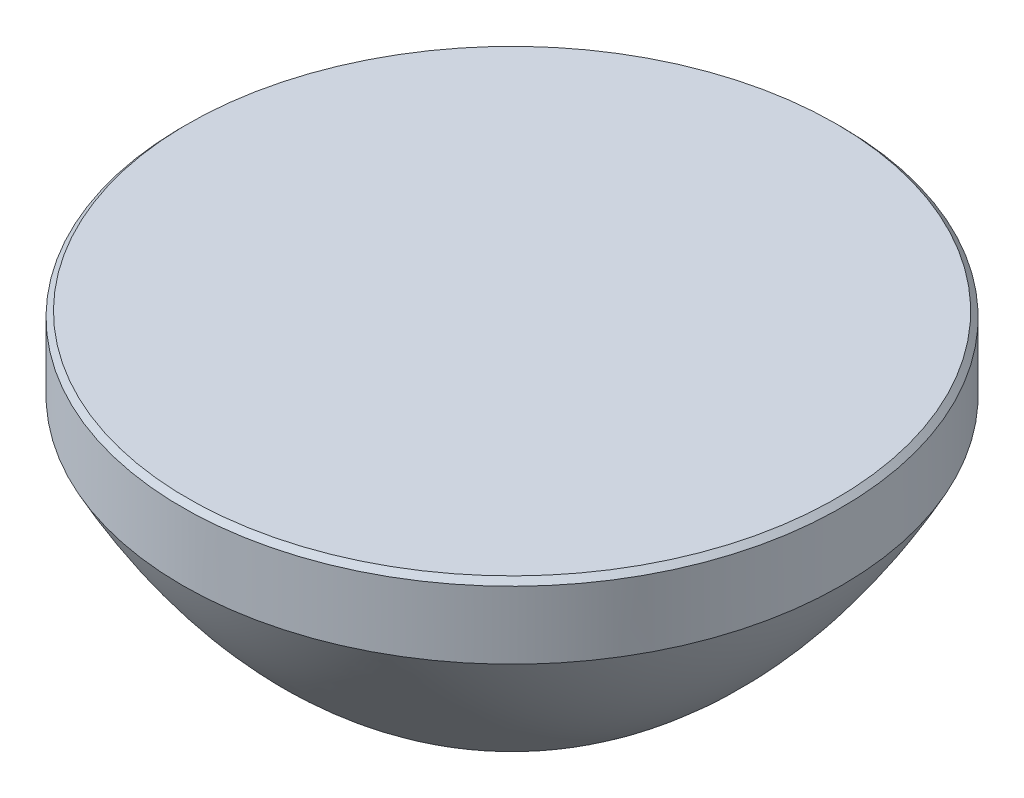
ISO-10303-21;
HEADER;
FILE_DESCRIPTION(('STEP AP214'),'2;1');
FILE_NAME('part.step','',(''),(''),'','','');
FILE_SCHEMA(('AUTOMOTIVE_DESIGN { 1 0 10303 214 1 1 1 1 }'));
ENDSEC;
DATA;
#1=APPLICATION_CONTEXT('core data for automotive mechanical design processes');
#2=APPLICATION_PROTOCOL_DEFINITION('international standard','automotive_design',2000,#1);
#3=PRODUCT_CONTEXT('',#1,'mechanical');
#4=PRODUCT('Part','Part','',(#3));
#5=PRODUCT_RELATED_PRODUCT_CATEGORY('part','',(#4));
#6=PRODUCT_DEFINITION_FORMATION('','',#4);
#7=PRODUCT_DEFINITION_CONTEXT('part definition',#1,'design');
#8=PRODUCT_DEFINITION('design','',#6,#7);
#9=PRODUCT_DEFINITION_SHAPE('','',#8);
#10=(LENGTH_UNIT() NAMED_UNIT(*) SI_UNIT(.MILLI.,.METRE.));
#11=(NAMED_UNIT(*) PLANE_ANGLE_UNIT() SI_UNIT($,.RADIAN.));
#12=(NAMED_UNIT(*) SI_UNIT($,.STERADIAN.) SOLID_ANGLE_UNIT());
#13=UNCERTAINTY_MEASURE_WITH_UNIT(LENGTH_MEASURE(1.E-05),#10,'distance_accuracy_value','');
#14=(GEOMETRIC_REPRESENTATION_CONTEXT(3) GLOBAL_UNCERTAINTY_ASSIGNED_CONTEXT((#13)) GLOBAL_UNIT_ASSIGNED_CONTEXT((#10,
#11,#12)) REPRESENTATION_CONTEXT('',''));
#15=CARTESIAN_POINT('',(0.,0.,0.));
#16=DIRECTION('',(0.,0.,1.));
#17=DIRECTION('',(1.,0.,0.));
#18=AXIS2_PLACEMENT_3D('',#15,#16,#17);
#19=CARTESIAN_POINT('',(0.,5.79999999999996,0.));
#20=DIRECTION('',(0.,-1.,0.));
#21=DIRECTION('',(0.,0.,-1.));
#22=AXIS2_PLACEMENT_3D('',#19,#20,#21);
#23=CONICAL_SURFACE('',#22,12.4999999999997,0.785398163397448);
#24=CARTESIAN_POINT('',(0.,6.,0.));
#25=DIRECTION('',(0.,-1.,0.));
#26=DIRECTION('',(0.,0.,-1.));
#27=AXIS2_PLACEMENT_3D('',#24,#25,#26);
#28=CIRCLE('',#27,12.2999999999996);
#29=CARTESIAN_POINT('',(0.,6.,-12.2999999999996));
#30=VERTEX_POINT('',#29);
#31=EDGE_CURVE('E11',#30,#30,#28,.T.);
#32=ORIENTED_EDGE('',*,*,#31,.T.);
#33=EDGE_LOOP('',(#32));
#34=FACE_BOUND('',#33,.T.);
#35=CARTESIAN_POINT('',(0.,5.79999999999996,0.));
#36=DIRECTION('',(0.,-1.,0.));
#37=DIRECTION('',(0.,0.,-1.));
#38=AXIS2_PLACEMENT_3D('',#35,#36,#37);
#39=CIRCLE('',#38,12.4999999999997);
#40=CARTESIAN_POINT('',(0.,5.79999999999996,-12.4999999999997));
#41=VERTEX_POINT('',#40);
#42=EDGE_CURVE('E69',#41,#41,#39,.T.);
#43=ORIENTED_EDGE('',*,*,#42,.F.);
#44=EDGE_LOOP('',(#43));
#45=FACE_BOUND('',#44,.T.);
#46=ADVANCED_FACE('F37',(#34,#45),#23,.T.);
#47=CARTESIAN_POINT('',(12.2999999999996,6.,0.));
#48=DIRECTION('',(0.,1.,0.));
#49=DIRECTION('',(0.,0.,1.));
#50=AXIS2_PLACEMENT_3D('',#47,#48,#49);
#51=PLANE('',#50);
#52=ORIENTED_EDGE('',*,*,#31,.F.);
#53=EDGE_LOOP('',(#52));
#54=FACE_BOUND('',#53,.T.);
#55=ADVANCED_FACE('F49',(#54),#51,.T.);
#56=CARTESIAN_POINT('',(-2.93111747732703,30.4948756299857,0.));
#57=DIRECTION('',(0.,0.,1.));
#58=DIRECTION('',(-0.111787877900256,0.993732091840934,0.));
#59=AXIS2_PLACEMENT_3D('',#56,#57,#58);
#60=ELLIPSE('',#59,36.6570476725691,19.8724493474562);
#61=TRIMMED_CURVE('',#60,(PARAMETER_VALUE(3.08283739584976)),
(PARAMETER_VALUE(5.93273513071163)),.T.,.PARAMETER.);
#62=CARTESIAN_POINT('',(0.,6.,0.));
#63=DIRECTION('',(0.,-1.,0.));
#64=AXIS1_PLACEMENT('',#62,#63);
#65=SURFACE_OF_REVOLUTION('',#61,#64);
#66=CARTESIAN_POINT('',(0.,3.2393470038026,0.));
#67=DIRECTION('',(0.,-1.,0.));
#68=DIRECTION('',(0.,0.,-1.));
#69=AXIS2_PLACEMENT_3D('',#66,#67,#68);
#70=CIRCLE('',#69,12.4999999999997);
#71=CARTESIAN_POINT('',(0.,3.2393470038026,-12.4999999999997));
#72=VERTEX_POINT('',#71);
#73=EDGE_CURVE('E43',#72,#72,#70,.T.);
#74=ORIENTED_EDGE('',*,*,#73,.T.);
#75=EDGE_LOOP('',(#74));
#76=FACE_BOUND('',#75,.T.);
#77=CARTESIAN_POINT('',(0.,-6.,0.));
#78=VERTEX_POINT('',#77);
#79=VERTEX_LOOP('',#78);
#80=FACE_BOUND('',#79,.T.);
#81=ADVANCED_FACE('F46',(#76,#80),#65,.F.);
#82=CARTESIAN_POINT('',(0.,6.,0.));
#83=DIRECTION('',(0.,-1.,0.));
#84=DIRECTION('',(0.,0.,-1.));
#85=AXIS2_PLACEMENT_3D('',#82,#83,#84);
#86=CYLINDRICAL_SURFACE('',#85,12.4999999999997);
#87=ORIENTED_EDGE('',*,*,#42,.T.);
#88=EDGE_LOOP('',(#87));
#89=FACE_BOUND('',#88,.T.);
#90=ORIENTED_EDGE('',*,*,#73,.F.);
#91=EDGE_LOOP('',(#90));
#92=FACE_BOUND('',#91,.T.);
#93=ADVANCED_FACE('F48',(#89,#92),#86,.T.);
#94=CLOSED_SHELL('',(#46,#55,#81,#93));
#95=MANIFOLD_SOLID_BREP('B2',#94);
#96=ADVANCED_BREP_SHAPE_REPRESENTATION('',(#18,#95),#14);
#97=SHAPE_DEFINITION_REPRESENTATION(#9,#96);
ENDSEC;
END-ISO-10303-21;
